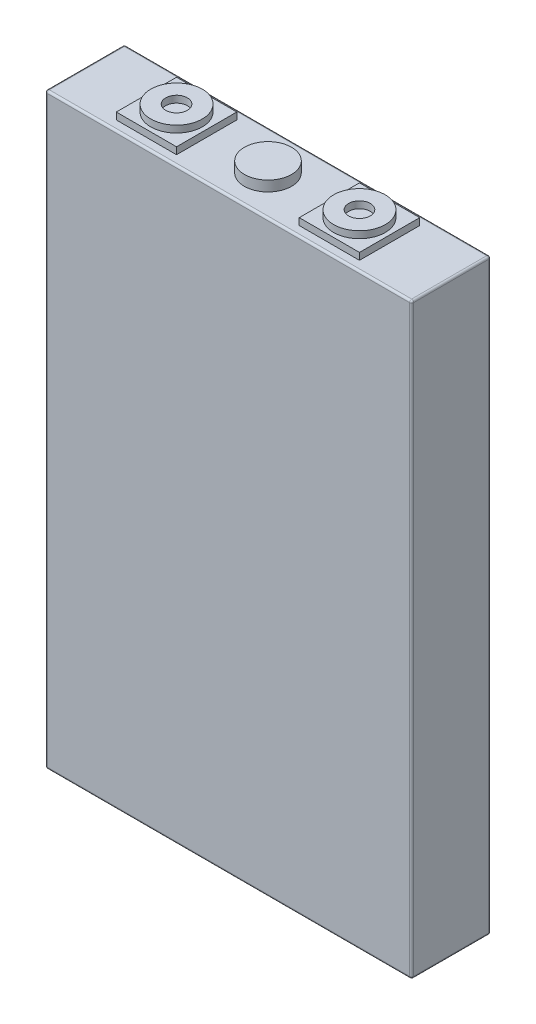
ISO-10303-21;
HEADER;
FILE_DESCRIPTION(('STEP AP214'),'2;1');
FILE_NAME('part.step','',(''),(''),'','','');
FILE_SCHEMA(('AUTOMOTIVE_DESIGN { 1 0 10303 214 1 1 1 1 }'));
ENDSEC;
DATA;
#1=APPLICATION_CONTEXT('core data for automotive mechanical design processes');
#2=APPLICATION_PROTOCOL_DEFINITION('international standard','automotive_design',2000,#1);
#3=PRODUCT_CONTEXT('',#1,'mechanical');
#4=PRODUCT('Part','Part','',(#3));
#5=PRODUCT_RELATED_PRODUCT_CATEGORY('part','',(#4));
#6=PRODUCT_DEFINITION_FORMATION('','',#4);
#7=PRODUCT_DEFINITION_CONTEXT('part definition',#1,'design');
#8=PRODUCT_DEFINITION('design','',#6,#7);
#9=PRODUCT_DEFINITION_SHAPE('','',#8);
#10=(LENGTH_UNIT() NAMED_UNIT(*) SI_UNIT(.MILLI.,.METRE.));
#11=(NAMED_UNIT(*) PLANE_ANGLE_UNIT() SI_UNIT($,.RADIAN.));
#12=(NAMED_UNIT(*) SI_UNIT($,.STERADIAN.) SOLID_ANGLE_UNIT());
#13=UNCERTAINTY_MEASURE_WITH_UNIT(LENGTH_MEASURE(1.E-05),#10,'distance_accuracy_value','');
#14=(GEOMETRIC_REPRESENTATION_CONTEXT(3) GLOBAL_UNCERTAINTY_ASSIGNED_CONTEXT((#13)) GLOBAL_UNIT_ASSIGNED_CONTEXT((#10,
#11,#12)) REPRESENTATION_CONTEXT('',''));
#15=CARTESIAN_POINT('',(0.,0.,0.));
#16=DIRECTION('',(0.,0.,1.));
#17=DIRECTION('',(1.,0.,0.));
#18=AXIS2_PLACEMENT_3D('',#15,#16,#17);
#19=CARTESIAN_POINT('',(67.6,220.61,-14.6));
#20=DIRECTION('',(0.,-1.,0.));
#21=DIRECTION('',(0.,0.,-1.));
#22=AXIS2_PLACEMENT_3D('',#19,#20,#21);
#23=CYLINDRICAL_SURFACE('',#22,8.69809987955637);
#24=CARTESIAN_POINT('',(67.6,220.61,-14.6));
#25=DIRECTION('',(0.,1.,0.));
#26=DIRECTION('',(0.,0.,1.));
#27=AXIS2_PLACEMENT_3D('',#24,#25,#26);
#28=CIRCLE('',#27,8.69809987955637);
#29=CARTESIAN_POINT('',(67.6,220.61,-5.90190012044363));
#30=VERTEX_POINT('',#29);
#31=EDGE_CURVE('E11',#30,#30,#28,.T.);
#32=ORIENTED_EDGE('',*,*,#31,.F.);
#33=EDGE_LOOP('',(#32));
#34=FACE_BOUND('',#33,.T.);
#35=CARTESIAN_POINT('',(67.6,216.8,-14.6));
#36=DIRECTION('',(0.,1.,0.));
#37=DIRECTION('',(0.,0.,1.));
#38=AXIS2_PLACEMENT_3D('',#35,#36,#37);
#39=CIRCLE('',#38,8.69809987955637);
#40=CARTESIAN_POINT('',(67.6,216.8,-5.90190012044363));
#41=VERTEX_POINT('',#40);
#42=EDGE_CURVE('E43',#41,#41,#39,.T.);
#43=ORIENTED_EDGE('',*,*,#42,.T.);
#44=EDGE_LOOP('',(#43));
#45=FACE_BOUND('',#44,.T.);
#46=ADVANCED_FACE('F40',(#34,#45),#23,.T.);
#47=CARTESIAN_POINT('',(67.6,220.61,-14.6));
#48=DIRECTION('',(0.,1.,0.));
#49=DIRECTION('',(0.,0.,1.));
#50=AXIS2_PLACEMENT_3D('',#47,#48,#49);
#51=PLANE('',#50);
#52=ORIENTED_EDGE('',*,*,#31,.T.);
#53=EDGE_LOOP('',(#52));
#54=FACE_BOUND('',#53,.T.);
#55=ADVANCED_FACE('F55',(#54),#51,.T.);
#56=CARTESIAN_POINT('',(67.6,216.8,-14.6));
#57=DIRECTION('',(0.,1.,0.));
#58=DIRECTION('',(0.,0.,1.));
#59=AXIS2_PLACEMENT_3D('',#56,#57,#58);
#60=PLANE('',#59);
#61=ORIENTED_EDGE('',*,*,#42,.F.);
#62=EDGE_LOOP('',(#61));
#63=FACE_BOUND('',#62,.T.);
#64=ADVANCED_FACE('F53',(#63),#60,.F.);
#65=CLOSED_SHELL('',(#46,#55,#64));
#66=MANIFOLD_SOLID_BREP('B2',#65);
#67=CARTESIAN_POINT('',(101.35,221.88,-14.6));
#68=DIRECTION('',(0.,1.,0.));
#69=DIRECTION('',(0.,0.,1.));
#70=AXIS2_PLACEMENT_3D('',#67,#68,#69);
#71=PLANE('',#70);
#72=CARTESIAN_POINT('',(101.35,221.88,-14.6));
#73=DIRECTION('',(0.,1.,0.));
#74=DIRECTION('',(0.,0.,1.));
#75=AXIS2_PLACEMENT_3D('',#72,#73,#74);
#76=CIRCLE('',#75,9.52500000000001);
#77=CARTESIAN_POINT('',(101.35,221.88,-5.07500000000001));
#78=VERTEX_POINT('',#77);
#79=EDGE_CURVE('E39',#78,#78,#76,.T.);
#80=ORIENTED_EDGE('',*,*,#79,.T.);
#81=EDGE_LOOP('',(#80));
#82=FACE_BOUND('',#81,.T.);
#83=CARTESIAN_POINT('',(101.35,221.88,-14.6));
#84=DIRECTION('',(0.,1.,0.));
#85=DIRECTION('',(0.,0.,1.));
#86=AXIS2_PLACEMENT_3D('',#83,#84,#85);
#87=CIRCLE('',#86,4.00000000000001);
#88=CARTESIAN_POINT('',(101.35,221.88,-10.6));
#89=VERTEX_POINT('',#88);
#90=EDGE_CURVE('E100',#89,#89,#87,.T.);
#91=ORIENTED_EDGE('',*,*,#90,.F.);
#92=EDGE_LOOP('',(#91));
#93=FACE_BOUND('',#92,.T.);
#94=ADVANCED_FACE('F89',(#82,#93),#71,.T.);
#95=CARTESIAN_POINT('',(101.35,219.34,-14.6));
#96=DIRECTION('',(0.,1.,0.));
#97=DIRECTION('',(0.,0.,1.));
#98=AXIS2_PLACEMENT_3D('',#95,#96,#97);
#99=PLANE('',#98);
#100=CARTESIAN_POINT('',(101.35,219.34,-14.6));
#101=DIRECTION('',(0.,1.,0.));
#102=DIRECTION('',(0.,0.,1.));
#103=AXIS2_PLACEMENT_3D('',#100,#101,#102);
#104=CIRCLE('',#103,9.52500000000001);
#105=CARTESIAN_POINT('',(101.35,219.34,-5.07500000000001));
#106=VERTEX_POINT('',#105);
#107=EDGE_CURVE('E93',#106,#106,#104,.T.);
#108=ORIENTED_EDGE('',*,*,#107,.F.);
#109=EDGE_LOOP('',(#108));
#110=FACE_BOUND('',#109,.T.);
#111=CARTESIAN_POINT('',(101.35,219.34,-14.6));
#112=DIRECTION('',(0.,1.,0.));
#113=DIRECTION('',(0.,0.,1.));
#114=AXIS2_PLACEMENT_3D('',#111,#112,#113);
#115=CIRCLE('',#114,4.00000000000001);
#116=CARTESIAN_POINT('',(101.35,219.34,-10.6));
#117=VERTEX_POINT('',#116);
#118=EDGE_CURVE('E102',#117,#117,#115,.T.);
#119=ORIENTED_EDGE('',*,*,#118,.T.);
#120=EDGE_LOOP('',(#119));
#121=FACE_BOUND('',#120,.T.);
#122=ADVANCED_FACE('F112',(#110,#121),#99,.F.);
#123=CARTESIAN_POINT('',(101.35,221.88,-14.6));
#124=DIRECTION('',(0.,-1.,0.));
#125=DIRECTION('',(0.,0.,-1.));
#126=AXIS2_PLACEMENT_3D('',#123,#124,#125);
#127=CYLINDRICAL_SURFACE('',#126,9.52500000000001);
#128=ORIENTED_EDGE('',*,*,#79,.F.);
#129=EDGE_LOOP('',(#128));
#130=FACE_BOUND('',#129,.T.);
#131=ORIENTED_EDGE('',*,*,#107,.T.);
#132=EDGE_LOOP('',(#131));
#133=FACE_BOUND('',#132,.T.);
#134=ADVANCED_FACE('F91',(#130,#133),#127,.T.);
#135=CARTESIAN_POINT('',(101.35,221.88,-14.6));
#136=DIRECTION('',(0.,-1.,0.));
#137=DIRECTION('',(0.,0.,-1.));
#138=AXIS2_PLACEMENT_3D('',#135,#136,#137);
#139=CYLINDRICAL_SURFACE('',#138,4.00000000000001);
#140=ORIENTED_EDGE('',*,*,#90,.T.);
#141=EDGE_LOOP('',(#140));
#142=FACE_BOUND('',#141,.T.);
#143=ORIENTED_EDGE('',*,*,#118,.F.);
#144=EDGE_LOOP('',(#143));
#145=FACE_BOUND('',#144,.T.);
#146=ADVANCED_FACE('F108',(#142,#145),#139,.F.);
#147=CLOSED_SHELL('',(#94,#122,#134,#146));
#148=MANIFOLD_SOLID_BREP('B6',#147);
#149=CARTESIAN_POINT('',(33.85,221.88,-14.6));
#150=DIRECTION('',(0.,1.,0.));
#151=DIRECTION('',(0.,0.,1.));
#152=AXIS2_PLACEMENT_3D('',#149,#150,#151);
#153=PLANE('',#152);
#154=CARTESIAN_POINT('',(33.85,221.88,-14.6));
#155=DIRECTION('',(0.,1.,0.));
#156=DIRECTION('',(0.,0.,1.));
#157=AXIS2_PLACEMENT_3D('',#154,#155,#156);
#158=CIRCLE('',#157,9.525);
#159=CARTESIAN_POINT('',(33.85,221.88,-5.07500000000002));
#160=VERTEX_POINT('',#159);
#161=EDGE_CURVE('E88',#160,#160,#158,.T.);
#162=ORIENTED_EDGE('',*,*,#161,.T.);
#163=EDGE_LOOP('',(#162));
#164=FACE_BOUND('',#163,.T.);
#165=CARTESIAN_POINT('',(33.85,221.88,-14.6));
#166=DIRECTION('',(0.,1.,0.));
#167=DIRECTION('',(0.,0.,1.));
#168=AXIS2_PLACEMENT_3D('',#165,#166,#167);
#169=CIRCLE('',#168,4.);
#170=CARTESIAN_POINT('',(33.85,221.88,-10.6));
#171=VERTEX_POINT('',#170);
#172=EDGE_CURVE('E172',#171,#171,#169,.T.);
#173=ORIENTED_EDGE('',*,*,#172,.F.);
#174=EDGE_LOOP('',(#173));
#175=FACE_BOUND('',#174,.T.);
#176=ADVANCED_FACE('F161',(#164,#175),#153,.T.);
#177=CARTESIAN_POINT('',(33.85,219.34,-14.6));
#178=DIRECTION('',(0.,1.,0.));
#179=DIRECTION('',(0.,0.,1.));
#180=AXIS2_PLACEMENT_3D('',#177,#178,#179);
#181=PLANE('',#180);
#182=CARTESIAN_POINT('',(33.85,219.34,-14.6));
#183=DIRECTION('',(0.,1.,0.));
#184=DIRECTION('',(0.,0.,1.));
#185=AXIS2_PLACEMENT_3D('',#182,#183,#184);
#186=CIRCLE('',#185,9.525);
#187=CARTESIAN_POINT('',(33.85,219.34,-5.07500000000002));
#188=VERTEX_POINT('',#187);
#189=EDGE_CURVE('E165',#188,#188,#186,.T.);
#190=ORIENTED_EDGE('',*,*,#189,.F.);
#191=EDGE_LOOP('',(#190));
#192=FACE_BOUND('',#191,.T.);
#193=CARTESIAN_POINT('',(33.85,219.34,-14.6));
#194=DIRECTION('',(0.,1.,0.));
#195=DIRECTION('',(0.,0.,1.));
#196=AXIS2_PLACEMENT_3D('',#193,#194,#195);
#197=CIRCLE('',#196,4.);
#198=CARTESIAN_POINT('',(33.85,219.34,-10.6));
#199=VERTEX_POINT('',#198);
#200=EDGE_CURVE('E174',#199,#199,#197,.T.);
#201=ORIENTED_EDGE('',*,*,#200,.T.);
#202=EDGE_LOOP('',(#201));
#203=FACE_BOUND('',#202,.T.);
#204=ADVANCED_FACE('F184',(#192,#203),#181,.F.);
#205=CARTESIAN_POINT('',(33.85,221.88,-14.6));
#206=DIRECTION('',(0.,-1.,0.));
#207=DIRECTION('',(0.,0.,-1.));
#208=AXIS2_PLACEMENT_3D('',#205,#206,#207);
#209=CYLINDRICAL_SURFACE('',#208,9.525);
#210=ORIENTED_EDGE('',*,*,#161,.F.);
#211=EDGE_LOOP('',(#210));
#212=FACE_BOUND('',#211,.T.);
#213=ORIENTED_EDGE('',*,*,#189,.T.);
#214=EDGE_LOOP('',(#213));
#215=FACE_BOUND('',#214,.T.);
#216=ADVANCED_FACE('F163',(#212,#215),#209,.T.);
#217=CARTESIAN_POINT('',(33.85,221.88,-14.6));
#218=DIRECTION('',(0.,-1.,0.));
#219=DIRECTION('',(0.,0.,-1.));
#220=AXIS2_PLACEMENT_3D('',#217,#218,#219);
#221=CYLINDRICAL_SURFACE('',#220,4.);
#222=ORIENTED_EDGE('',*,*,#172,.T.);
#223=EDGE_LOOP('',(#222));
#224=FACE_BOUND('',#223,.T.);
#225=ORIENTED_EDGE('',*,*,#200,.F.);
#226=EDGE_LOOP('',(#225));
#227=FACE_BOUND('',#226,.T.);
#228=ADVANCED_FACE('F180',(#224,#227),#221,.F.);
#229=CLOSED_SHELL('',(#176,#204,#216,#228));
#230=MANIFOLD_SOLID_BREP('B34',#229);
#231=CARTESIAN_POINT('',(112.4625,219.34,-25.7125));
#232=DIRECTION('',(-1.,0.,0.));
#233=DIRECTION('',(0.,0.,1.));
#234=AXIS2_PLACEMENT_3D('',#231,#232,#233);
#235=PLANE('',#234);
#236=DIRECTION('',(0.,0.,-1.));
#237=VECTOR('',#236,1.);
#238=CARTESIAN_POINT('',(112.4625,216.8,-25.7125));
#239=LINE('',#238,#237);
#240=CARTESIAN_POINT('',(112.4625,216.8,-3.48750000000002));
#241=VERTEX_POINT('',#240);
#242=CARTESIAN_POINT('',(112.4625,216.8,-25.7125));
#243=VERTEX_POINT('',#242);
#244=EDGE_CURVE('E296',#241,#243,#239,.T.);
#245=ORIENTED_EDGE('',*,*,#244,.T.);
#246=DIRECTION('',(0.,-1.,0.));
#247=VECTOR('',#246,1.);
#248=CARTESIAN_POINT('',(112.4625,219.34,-25.7125));
#249=LINE('',#248,#247);
#250=CARTESIAN_POINT('',(112.4625,219.34,-25.7125));
#251=VERTEX_POINT('',#250);
#252=EDGE_CURVE('E159',#251,#243,#249,.T.);
#253=ORIENTED_EDGE('',*,*,#252,.F.);
#254=DIRECTION('',(0.,0.,-1.));
#255=VECTOR('',#254,1.);
#256=CARTESIAN_POINT('',(112.4625,219.34,-25.7125));
#257=LINE('',#256,#255);
#258=CARTESIAN_POINT('',(112.4625,219.34,-3.48750000000002));
#259=VERTEX_POINT('',#258);
#260=EDGE_CURVE('E284',#259,#251,#257,.T.);
#261=ORIENTED_EDGE('',*,*,#260,.F.);
#262=DIRECTION('',(0.,-1.,0.));
#263=VECTOR('',#262,1.);
#264=CARTESIAN_POINT('',(112.4625,219.34,-3.48750000000002));
#265=LINE('',#264,#263);
#266=EDGE_CURVE('E292',#259,#241,#265,.T.);
#267=ORIENTED_EDGE('',*,*,#266,.T.);
#268=EDGE_LOOP('',(#245,#253,#261,#267));
#269=FACE_BOUND('',#268,.T.);
#270=ADVANCED_FACE('F233',(#269),#235,.F.);
#271=CARTESIAN_POINT('',(90.2375,219.34,-25.7125));
#272=DIRECTION('',(0.,0.,1.));
#273=DIRECTION('',(1.,0.,0.));
#274=AXIS2_PLACEMENT_3D('',#271,#272,#273);
#275=PLANE('',#274);
#276=DIRECTION('',(-1.,0.,0.));
#277=VECTOR('',#276,1.);
#278=CARTESIAN_POINT('',(90.2375,216.8,-25.7125));
#279=LINE('',#278,#277);
#280=CARTESIAN_POINT('',(90.2375,216.8,-25.7125));
#281=VERTEX_POINT('',#280);
#282=EDGE_CURVE('E288',#243,#281,#279,.T.);
#283=ORIENTED_EDGE('',*,*,#282,.T.);
#284=DIRECTION('',(0.,-1.,0.));
#285=VECTOR('',#284,1.);
#286=CARTESIAN_POINT('',(90.2375,219.34,-25.7125));
#287=LINE('',#286,#285);
#288=CARTESIAN_POINT('',(90.2375,219.34,-25.7125));
#289=VERTEX_POINT('',#288);
#290=EDGE_CURVE('E241',#289,#281,#287,.T.);
#291=ORIENTED_EDGE('',*,*,#290,.F.);
#292=DIRECTION('',(-1.,0.,0.));
#293=VECTOR('',#292,1.);
#294=CARTESIAN_POINT('',(90.2375,219.34,-25.7125));
#295=LINE('',#294,#293);
#296=EDGE_CURVE('E279',#251,#289,#295,.T.);
#297=ORIENTED_EDGE('',*,*,#296,.F.);
#298=ORIENTED_EDGE('',*,*,#252,.T.);
#299=EDGE_LOOP('',(#283,#291,#297,#298));
#300=FACE_BOUND('',#299,.T.);
#301=ADVANCED_FACE('F287',(#300),#275,.F.);
#302=CARTESIAN_POINT('',(90.2375,219.34,-25.7125));
#303=DIRECTION('',(1.,0.,0.));
#304=DIRECTION('',(0.,0.,-1.));
#305=AXIS2_PLACEMENT_3D('',#302,#303,#304);
#306=PLANE('',#305);
#307=DIRECTION('',(0.,0.,1.));
#308=VECTOR('',#307,1.);
#309=CARTESIAN_POINT('',(90.2375,216.8,-25.7125));
#310=LINE('',#309,#308);
#311=CARTESIAN_POINT('',(90.2375,216.8,-3.48750000000002));
#312=VERTEX_POINT('',#311);
#313=EDGE_CURVE('E266',#281,#312,#310,.T.);
#314=ORIENTED_EDGE('',*,*,#313,.T.);
#315=DIRECTION('',(0.,-1.,0.));
#316=VECTOR('',#315,1.);
#317=CARTESIAN_POINT('',(90.2375,219.34,-3.48750000000002));
#318=LINE('',#317,#316);
#319=CARTESIAN_POINT('',(90.2375,219.34,-3.48750000000002));
#320=VERTEX_POINT('',#319);
#321=EDGE_CURVE('E289',#320,#312,#318,.T.);
#322=ORIENTED_EDGE('',*,*,#321,.F.);
#323=DIRECTION('',(0.,0.,1.));
#324=VECTOR('',#323,1.);
#325=CARTESIAN_POINT('',(90.2375,219.34,-25.7125));
#326=LINE('',#325,#324);
#327=EDGE_CURVE('E282',#289,#320,#326,.T.);
#328=ORIENTED_EDGE('',*,*,#327,.F.);
#329=ORIENTED_EDGE('',*,*,#290,.T.);
#330=EDGE_LOOP('',(#314,#322,#328,#329));
#331=FACE_BOUND('',#330,.T.);
#332=ADVANCED_FACE('F290',(#331),#306,.F.);
#333=CARTESIAN_POINT('',(90.2375,219.34,-3.48750000000002));
#334=DIRECTION('',(0.,0.,-1.));
#335=DIRECTION('',(-1.,0.,0.));
#336=AXIS2_PLACEMENT_3D('',#333,#334,#335);
#337=PLANE('',#336);
#338=DIRECTION('',(1.,0.,0.));
#339=VECTOR('',#338,1.);
#340=CARTESIAN_POINT('',(90.2375,216.8,-3.48750000000002));
#341=LINE('',#340,#339);
#342=EDGE_CURVE('E272',#312,#241,#341,.T.);
#343=ORIENTED_EDGE('',*,*,#342,.T.);
#344=ORIENTED_EDGE('',*,*,#266,.F.);
#345=DIRECTION('',(1.,0.,0.));
#346=VECTOR('',#345,1.);
#347=CARTESIAN_POINT('',(90.2375,219.34,-3.48750000000002));
#348=LINE('',#347,#346);
#349=EDGE_CURVE('E249',#320,#259,#348,.T.);
#350=ORIENTED_EDGE('',*,*,#349,.F.);
#351=ORIENTED_EDGE('',*,*,#321,.T.);
#352=EDGE_LOOP('',(#343,#344,#350,#351));
#353=FACE_BOUND('',#352,.T.);
#354=ADVANCED_FACE('F303',(#353),#337,.F.);
#355=CARTESIAN_POINT('',(112.4625,219.34,-3.48750000000002));
#356=DIRECTION('',(0.,1.,0.));
#357=DIRECTION('',(0.,0.,1.));
#358=AXIS2_PLACEMENT_3D('',#355,#356,#357);
#359=PLANE('',#358);
#360=ORIENTED_EDGE('',*,*,#260,.T.);
#361=ORIENTED_EDGE('',*,*,#296,.T.);
#362=ORIENTED_EDGE('',*,*,#327,.T.);
#363=ORIENTED_EDGE('',*,*,#349,.T.);
#364=EDGE_LOOP('',(#360,#361,#362,#363));
#365=FACE_BOUND('',#364,.T.);
#366=ADVANCED_FACE('F280',(#365),#359,.T.);
#367=CARTESIAN_POINT('',(112.4625,216.8,-3.48750000000002));
#368=DIRECTION('',(0.,1.,0.));
#369=DIRECTION('',(0.,0.,1.));
#370=AXIS2_PLACEMENT_3D('',#367,#368,#369);
#371=PLANE('',#370);
#372=ORIENTED_EDGE('',*,*,#244,.F.);
#373=ORIENTED_EDGE('',*,*,#342,.F.);
#374=ORIENTED_EDGE('',*,*,#313,.F.);
#375=ORIENTED_EDGE('',*,*,#282,.F.);
#376=EDGE_LOOP('',(#372,#373,#374,#375));
#377=FACE_BOUND('',#376,.T.);
#378=ADVANCED_FACE('F306',(#377),#371,.F.);
#379=CLOSED_SHELL('',(#270,#301,#332,#354,#366,#378));
#380=MANIFOLD_SOLID_BREP('B83',#379);
#381=CARTESIAN_POINT('',(22.7375,219.34,-25.7125));
#382=DIRECTION('',(1.,0.,0.));
#383=DIRECTION('',(0.,0.,-1.));
#384=AXIS2_PLACEMENT_3D('',#381,#382,#383);
#385=PLANE('',#384);
#386=DIRECTION('',(0.,0.,1.));
#387=VECTOR('',#386,1.);
#388=CARTESIAN_POINT('',(22.7375,216.8,-25.7125));
#389=LINE('',#388,#387);
#390=CARTESIAN_POINT('',(22.7375,216.8,-25.7125));
#391=VERTEX_POINT('',#390);
#392=CARTESIAN_POINT('',(22.7375,216.8,-3.48750000000002));
#393=VERTEX_POINT('',#392);
#394=EDGE_CURVE('E429',#391,#393,#389,.T.);
#395=ORIENTED_EDGE('',*,*,#394,.T.);
#396=DIRECTION('',(0.,-1.,0.));
#397=VECTOR('',#396,1.);
#398=CARTESIAN_POINT('',(22.7375,219.34,-3.48750000000002));
#399=LINE('',#398,#397);
#400=CARTESIAN_POINT('',(22.7375,219.34,-3.48750000000002));
#401=VERTEX_POINT('',#400);
#402=EDGE_CURVE('E231',#401,#393,#399,.T.);
#403=ORIENTED_EDGE('',*,*,#402,.F.);
#404=DIRECTION('',(0.,0.,1.));
#405=VECTOR('',#404,1.);
#406=CARTESIAN_POINT('',(22.7375,219.34,-25.7125));
#407=LINE('',#406,#405);
#408=CARTESIAN_POINT('',(22.7375,219.34,-25.7125));
#409=VERTEX_POINT('',#408);
#410=EDGE_CURVE('E417',#409,#401,#407,.T.);
#411=ORIENTED_EDGE('',*,*,#410,.F.);
#412=DIRECTION('',(0.,-1.,0.));
#413=VECTOR('',#412,1.);
#414=CARTESIAN_POINT('',(22.7375,219.34,-25.7125));
#415=LINE('',#414,#413);
#416=EDGE_CURVE('E425',#409,#391,#415,.T.);
#417=ORIENTED_EDGE('',*,*,#416,.T.);
#418=EDGE_LOOP('',(#395,#403,#411,#417));
#419=FACE_BOUND('',#418,.T.);
#420=ADVANCED_FACE('F366',(#419),#385,.F.);
#421=CARTESIAN_POINT('',(44.9625,219.34,-3.48750000000002));
#422=DIRECTION('',(0.,0.,-1.));
#423=DIRECTION('',(-1.,0.,0.));
#424=AXIS2_PLACEMENT_3D('',#421,#422,#423);
#425=PLANE('',#424);
#426=DIRECTION('',(1.,0.,0.));
#427=VECTOR('',#426,1.);
#428=CARTESIAN_POINT('',(44.9625,216.8,-3.48750000000002));
#429=LINE('',#428,#427);
#430=CARTESIAN_POINT('',(44.9625,216.8,-3.48750000000002));
#431=VERTEX_POINT('',#430);
#432=EDGE_CURVE('E421',#393,#431,#429,.T.);
#433=ORIENTED_EDGE('',*,*,#432,.T.);
#434=DIRECTION('',(0.,-1.,0.));
#435=VECTOR('',#434,1.);
#436=CARTESIAN_POINT('',(44.9625,219.34,-3.48750000000002));
#437=LINE('',#436,#435);
#438=CARTESIAN_POINT('',(44.9625,219.34,-3.48750000000002));
#439=VERTEX_POINT('',#438);
#440=EDGE_CURVE('E374',#439,#431,#437,.T.);
#441=ORIENTED_EDGE('',*,*,#440,.F.);
#442=DIRECTION('',(1.,0.,0.));
#443=VECTOR('',#442,1.);
#444=CARTESIAN_POINT('',(44.9625,219.34,-3.48750000000002));
#445=LINE('',#444,#443);
#446=EDGE_CURVE('E412',#401,#439,#445,.T.);
#447=ORIENTED_EDGE('',*,*,#446,.F.);
#448=ORIENTED_EDGE('',*,*,#402,.T.);
#449=EDGE_LOOP('',(#433,#441,#447,#448));
#450=FACE_BOUND('',#449,.T.);
#451=ADVANCED_FACE('F420',(#450),#425,.F.);
#452=CARTESIAN_POINT('',(44.9625,219.34,-25.7125));
#453=DIRECTION('',(-1.,0.,0.));
#454=DIRECTION('',(0.,0.,1.));
#455=AXIS2_PLACEMENT_3D('',#452,#453,#454);
#456=PLANE('',#455);
#457=DIRECTION('',(0.,0.,-1.));
#458=VECTOR('',#457,1.);
#459=CARTESIAN_POINT('',(44.9625,216.8,-25.7125));
#460=LINE('',#459,#458);
#461=CARTESIAN_POINT('',(44.9625,216.8,-25.7125));
#462=VERTEX_POINT('',#461);
#463=EDGE_CURVE('E399',#431,#462,#460,.T.);
#464=ORIENTED_EDGE('',*,*,#463,.T.);
#465=DIRECTION('',(0.,-1.,0.));
#466=VECTOR('',#465,1.);
#467=CARTESIAN_POINT('',(44.9625,219.34,-25.7125));
#468=LINE('',#467,#466);
#469=CARTESIAN_POINT('',(44.9625,219.34,-25.7125));
#470=VERTEX_POINT('',#469);
#471=EDGE_CURVE('E422',#470,#462,#468,.T.);
#472=ORIENTED_EDGE('',*,*,#471,.F.);
#473=DIRECTION('',(0.,0.,-1.));
#474=VECTOR('',#473,1.);
#475=CARTESIAN_POINT('',(44.9625,219.34,-25.7125));
#476=LINE('',#475,#474);
#477=EDGE_CURVE('E415',#439,#470,#476,.T.);
#478=ORIENTED_EDGE('',*,*,#477,.F.);
#479=ORIENTED_EDGE('',*,*,#440,.T.);
#480=EDGE_LOOP('',(#464,#472,#478,#479));
#481=FACE_BOUND('',#480,.T.);
#482=ADVANCED_FACE('F423',(#481),#456,.F.);
#483=CARTESIAN_POINT('',(44.9625,219.34,-25.7125));
#484=DIRECTION('',(0.,0.,1.));
#485=DIRECTION('',(1.,0.,0.));
#486=AXIS2_PLACEMENT_3D('',#483,#484,#485);
#487=PLANE('',#486);
#488=DIRECTION('',(-1.,0.,0.));
#489=VECTOR('',#488,1.);
#490=CARTESIAN_POINT('',(44.9625,216.8,-25.7125));
#491=LINE('',#490,#489);
#492=EDGE_CURVE('E405',#462,#391,#491,.T.);
#493=ORIENTED_EDGE('',*,*,#492,.T.);
#494=ORIENTED_EDGE('',*,*,#416,.F.);
#495=DIRECTION('',(-1.,0.,0.));
#496=VECTOR('',#495,1.);
#497=CARTESIAN_POINT('',(44.9625,219.34,-25.7125));
#498=LINE('',#497,#496);
#499=EDGE_CURVE('E382',#470,#409,#498,.T.);
#500=ORIENTED_EDGE('',*,*,#499,.F.);
#501=ORIENTED_EDGE('',*,*,#471,.T.);
#502=EDGE_LOOP('',(#493,#494,#500,#501));
#503=FACE_BOUND('',#502,.T.);
#504=ADVANCED_FACE('F436',(#503),#487,.F.);
#505=CARTESIAN_POINT('',(22.7375,219.34,-3.48750000000002));
#506=DIRECTION('',(0.,-1.,0.));
#507=DIRECTION('',(0.,0.,-1.));
#508=AXIS2_PLACEMENT_3D('',#505,#506,#507);
#509=PLANE('',#508);
#510=ORIENTED_EDGE('',*,*,#410,.T.);
#511=ORIENTED_EDGE('',*,*,#446,.T.);
#512=ORIENTED_EDGE('',*,*,#477,.T.);
#513=ORIENTED_EDGE('',*,*,#499,.T.);
#514=EDGE_LOOP('',(#510,#511,#512,#513));
#515=FACE_BOUND('',#514,.T.);
#516=ADVANCED_FACE('F413',(#515),#509,.F.);
#517=CARTESIAN_POINT('',(22.7375,216.8,-3.48750000000002));
#518=DIRECTION('',(0.,-1.,0.));
#519=DIRECTION('',(0.,0.,-1.));
#520=AXIS2_PLACEMENT_3D('',#517,#518,#519);
#521=PLANE('',#520);
#522=ORIENTED_EDGE('',*,*,#394,.F.);
#523=ORIENTED_EDGE('',*,*,#492,.F.);
#524=ORIENTED_EDGE('',*,*,#463,.F.);
#525=ORIENTED_EDGE('',*,*,#432,.F.);
#526=EDGE_LOOP('',(#522,#523,#524,#525));
#527=FACE_BOUND('',#526,.T.);
#528=ADVANCED_FACE('F439',(#527),#521,.T.);
#529=CLOSED_SHELL('',(#420,#451,#482,#504,#516,#528));
#530=MANIFOLD_SOLID_BREP('B153',#529);
#531=CARTESIAN_POINT('',(0.,216.8,0.));
#532=DIRECTION('',(1.,0.,0.));
#533=DIRECTION('',(0.,0.,-1.));
#534=AXIS2_PLACEMENT_3D('',#531,#532,#533);
#535=PLANE('',#534);
#536=DIRECTION('',(0.,0.,1.));
#537=VECTOR('',#536,1.);
#538=CARTESIAN_POINT('',(0.,216.038,0.));
#539=LINE('',#538,#537);
#540=CARTESIAN_POINT('',(0.,216.038,-0.762));
#541=VERTEX_POINT('',#540);
#542=CARTESIAN_POINT('',(0.,216.038,-28.438));
#543=VERTEX_POINT('',#542);
#544=EDGE_CURVE('E499',#541,#543,#539,.F.);
#545=ORIENTED_EDGE('',*,*,#544,.T.);
#546=DIRECTION('',(0.,-1.,0.));
#547=VECTOR('',#546,1.);
#548=CARTESIAN_POINT('',(0.,216.8,-28.438));
#549=LINE('',#548,#547);
#550=CARTESIAN_POINT('',(0.,0.762000000000013,-28.438));
#551=VERTEX_POINT('',#550);
#552=EDGE_CURVE('E364',#543,#551,#549,.T.);
#553=ORIENTED_EDGE('',*,*,#552,.T.);
#554=DIRECTION('',(0.,0.,1.));
#555=VECTOR('',#554,1.);
#556=CARTESIAN_POINT('',(0.,0.762000000000013,0.));
#557=LINE('',#556,#555);
#558=CARTESIAN_POINT('',(0.,0.762000000000013,-0.762));
#559=VERTEX_POINT('',#558);
#560=EDGE_CURVE('E651',#551,#559,#557,.T.);
#561=ORIENTED_EDGE('',*,*,#560,.T.);
#562=DIRECTION('',(0.,-1.,0.));
#563=VECTOR('',#562,1.);
#564=CARTESIAN_POINT('',(0.,216.8,-0.762));
#565=LINE('',#564,#563);
#566=EDGE_CURVE('E510',#559,#541,#565,.F.);
#567=ORIENTED_EDGE('',*,*,#566,.T.);
#568=EDGE_LOOP('',(#545,#553,#561,#567));
#569=FACE_BOUND('',#568,.T.);
#570=ADVANCED_FACE('F490',(#569),#535,.F.);
#571=CARTESIAN_POINT('',(0.,216.8,0.));
#572=DIRECTION('',(0.,0.,-1.));
#573=DIRECTION('',(-1.,0.,0.));
#574=AXIS2_PLACEMENT_3D('',#571,#572,#573);
#575=PLANE('',#574);
#576=DIRECTION('',(0.,-1.,0.));
#577=VECTOR('',#576,1.);
#578=CARTESIAN_POINT('',(134.438,216.8,0.));
#579=LINE('',#578,#577);
#580=CARTESIAN_POINT('',(134.438,0.762000000000013,0.));
#581=VERTEX_POINT('',#580);
#582=CARTESIAN_POINT('',(134.438,216.038,0.));
#583=VERTEX_POINT('',#582);
#584=EDGE_CURVE('E646',#581,#583,#579,.F.);
#585=ORIENTED_EDGE('',*,*,#584,.T.);
#586=DIRECTION('',(1.,0.,0.));
#587=VECTOR('',#586,1.);
#588=CARTESIAN_POINT('',(0.,216.038,0.));
#589=LINE('',#588,#587);
#590=CARTESIAN_POINT('',(0.762,216.038,0.));
#591=VERTEX_POINT('',#590);
#592=EDGE_CURVE('E648',#583,#591,#589,.F.);
#593=ORIENTED_EDGE('',*,*,#592,.T.);
#594=DIRECTION('',(0.,-1.,0.));
#595=VECTOR('',#594,1.);
#596=CARTESIAN_POINT('',(0.762,216.8,0.));
#597=LINE('',#596,#595);
#598=CARTESIAN_POINT('',(0.762,0.762000000000013,0.));
#599=VERTEX_POINT('',#598);
#600=EDGE_CURVE('E642',#591,#599,#597,.T.);
#601=ORIENTED_EDGE('',*,*,#600,.T.);
#602=DIRECTION('',(1.,0.,0.));
#603=VECTOR('',#602,1.);
#604=CARTESIAN_POINT('',(135.2,0.762000000000013,0.));
#605=LINE('',#604,#603);
#606=EDGE_CURVE('E644',#599,#581,#605,.T.);
#607=ORIENTED_EDGE('',*,*,#606,.T.);
#608=EDGE_LOOP('',(#585,#593,#601,#607));
#609=FACE_BOUND('',#608,.T.);
#610=ADVANCED_FACE('F735',(#609),#575,.F.);
#611=CARTESIAN_POINT('',(135.2,216.8,0.));
#612=DIRECTION('',(-1.,0.,0.));
#613=DIRECTION('',(0.,0.,1.));
#614=AXIS2_PLACEMENT_3D('',#611,#612,#613);
#615=PLANE('',#614);
#616=DIRECTION('',(0.,-1.,0.));
#617=VECTOR('',#616,1.);
#618=CARTESIAN_POINT('',(135.2,216.8,-28.438));
#619=LINE('',#618,#617);
#620=CARTESIAN_POINT('',(135.2,0.762000000000013,-28.438));
#621=VERTEX_POINT('',#620);
#622=CARTESIAN_POINT('',(135.2,216.038,-28.438));
#623=VERTEX_POINT('',#622);
#624=EDGE_CURVE('E637',#621,#623,#619,.F.);
#625=ORIENTED_EDGE('',*,*,#624,.T.);
#626=DIRECTION('',(0.,0.,-1.));
#627=VECTOR('',#626,1.);
#628=CARTESIAN_POINT('',(135.2,216.038,0.));
#629=LINE('',#628,#627);
#630=CARTESIAN_POINT('',(135.2,216.038,-0.762));
#631=VERTEX_POINT('',#630);
#632=EDGE_CURVE('E639',#623,#631,#629,.F.);
#633=ORIENTED_EDGE('',*,*,#632,.T.);
#634=DIRECTION('',(0.,-1.,0.));
#635=VECTOR('',#634,1.);
#636=CARTESIAN_POINT('',(135.2,216.8,-0.762));
#637=LINE('',#636,#635);
#638=CARTESIAN_POINT('',(135.2,0.762000000000013,-0.762));
#639=VERTEX_POINT('',#638);
#640=EDGE_CURVE('E633',#631,#639,#637,.T.);
#641=ORIENTED_EDGE('',*,*,#640,.T.);
#642=DIRECTION('',(0.,0.,-1.));
#643=VECTOR('',#642,1.);
#644=CARTESIAN_POINT('',(135.2,0.762000000000013,-29.2));
#645=LINE('',#644,#643);
#646=EDGE_CURVE('E635',#639,#621,#645,.T.);
#647=ORIENTED_EDGE('',*,*,#646,.T.);
#648=EDGE_LOOP('',(#625,#633,#641,#647));
#649=FACE_BOUND('',#648,.T.);
#650=ADVANCED_FACE('F726',(#649),#615,.F.);
#651=CARTESIAN_POINT('',(0.,216.8,-29.2));
#652=DIRECTION('',(0.,0.,1.));
#653=DIRECTION('',(1.,0.,0.));
#654=AXIS2_PLACEMENT_3D('',#651,#652,#653);
#655=PLANE('',#654);
#656=DIRECTION('',(-1.,0.,0.));
#657=VECTOR('',#656,1.);
#658=CARTESIAN_POINT('',(0.,216.038,-29.2));
#659=LINE('',#658,#657);
#660=CARTESIAN_POINT('',(0.762,216.038,-29.2));
#661=VERTEX_POINT('',#660);
#662=CARTESIAN_POINT('',(134.438,216.038,-29.2));
#663=VERTEX_POINT('',#662);
#664=EDGE_CURVE('E586',#661,#663,#659,.F.);
#665=ORIENTED_EDGE('',*,*,#664,.T.);
#666=DIRECTION('',(0.,-1.,0.));
#667=VECTOR('',#666,1.);
#668=CARTESIAN_POINT('',(134.438,216.8,-29.2));
#669=LINE('',#668,#667);
#670=CARTESIAN_POINT('',(134.438,0.762000000000013,-29.2));
#671=VERTEX_POINT('',#670);
#672=EDGE_CURVE('E622',#663,#671,#669,.T.);
#673=ORIENTED_EDGE('',*,*,#672,.T.);
#674=DIRECTION('',(-1.,0.,0.));
#675=VECTOR('',#674,1.);
#676=CARTESIAN_POINT('',(0.,0.762000000000013,-29.2));
#677=LINE('',#676,#675);
#678=CARTESIAN_POINT('',(0.762,0.762000000000013,-29.2));
#679=VERTEX_POINT('',#678);
#680=EDGE_CURVE('E615',#671,#679,#677,.T.);
#681=ORIENTED_EDGE('',*,*,#680,.T.);
#682=DIRECTION('',(0.,-1.,0.));
#683=VECTOR('',#682,1.);
#684=CARTESIAN_POINT('',(0.762,216.8,-29.2));
#685=LINE('',#684,#683);
#686=EDGE_CURVE('E613',#679,#661,#685,.F.);
#687=ORIENTED_EDGE('',*,*,#686,.T.);
#688=EDGE_LOOP('',(#665,#673,#681,#687));
#689=FACE_BOUND('',#688,.T.);
#690=ADVANCED_FACE('F813',(#689),#655,.F.);
#691=CARTESIAN_POINT('',(0.,216.8,-29.2));
#692=DIRECTION('',(0.,-1.,0.));
#693=DIRECTION('',(0.,0.,-1.));
#694=AXIS2_PLACEMENT_3D('',#691,#692,#693);
#695=PLANE('',#694);
#696=DIRECTION('',(0.,0.,-1.));
#697=VECTOR('',#696,1.);
#698=CARTESIAN_POINT('',(134.438,216.8,-29.2));
#699=LINE('',#698,#697);
#700=CARTESIAN_POINT('',(134.438,216.8,-0.761999999999999));
#701=VERTEX_POINT('',#700);
#702=CARTESIAN_POINT('',(134.438,216.8,-28.438));
#703=VERTEX_POINT('',#702);
#704=EDGE_CURVE('E611',#701,#703,#699,.T.);
#705=ORIENTED_EDGE('',*,*,#704,.T.);
#706=DIRECTION('',(-1.,0.,0.));
#707=VECTOR('',#706,1.);
#708=CARTESIAN_POINT('',(0.,216.8,-28.438));
#709=LINE('',#708,#707);
#710=CARTESIAN_POINT('',(0.762,216.8,-28.438));
#711=VERTEX_POINT('',#710);
#712=EDGE_CURVE('E584',#703,#711,#709,.T.);
#713=ORIENTED_EDGE('',*,*,#712,.T.);
#714=DIRECTION('',(0.,0.,1.));
#715=VECTOR('',#714,1.);
#716=CARTESIAN_POINT('',(0.762,216.8,-29.2));
#717=LINE('',#716,#715);
#718=CARTESIAN_POINT('',(0.762,216.8,-0.761999999999999));
#719=VERTEX_POINT('',#718);
#720=EDGE_CURVE('E601',#711,#719,#717,.T.);
#721=ORIENTED_EDGE('',*,*,#720,.T.);
#722=DIRECTION('',(1.,0.,0.));
#723=VECTOR('',#722,1.);
#724=CARTESIAN_POINT('',(0.,216.8,-0.761999999999999));
#725=LINE('',#724,#723);
#726=EDGE_CURVE('E607',#719,#701,#725,.T.);
#727=ORIENTED_EDGE('',*,*,#726,.T.);
#728=EDGE_LOOP('',(#705,#713,#721,#727));
#729=FACE_BOUND('',#728,.T.);
#730=ADVANCED_FACE('F609',(#729),#695,.F.);
#731=CARTESIAN_POINT('',(0.,0.,-29.2));
#732=DIRECTION('',(0.,-1.,0.));
#733=DIRECTION('',(0.,0.,-1.));
#734=AXIS2_PLACEMENT_3D('',#731,#732,#733);
#735=PLANE('',#734);
#736=DIRECTION('',(0.,0.,1.));
#737=VECTOR('',#736,1.);
#738=CARTESIAN_POINT('',(0.762,0.,-29.2));
#739=LINE('',#738,#737);
#740=CARTESIAN_POINT('',(0.762,0.,-0.762));
#741=VERTEX_POINT('',#740);
#742=CARTESIAN_POINT('',(0.762,0.,-28.438));
#743=VERTEX_POINT('',#742);
#744=EDGE_CURVE('E624',#741,#743,#739,.F.);
#745=ORIENTED_EDGE('',*,*,#744,.T.);
#746=DIRECTION('',(-1.,0.,0.));
#747=VECTOR('',#746,1.);
#748=CARTESIAN_POINT('',(135.2,0.,-28.438));
#749=LINE('',#748,#747);
#750=CARTESIAN_POINT('',(134.438,0.,-28.438));
#751=VERTEX_POINT('',#750);
#752=EDGE_CURVE('E630',#743,#751,#749,.F.);
#753=ORIENTED_EDGE('',*,*,#752,.T.);
#754=DIRECTION('',(0.,0.,-1.));
#755=VECTOR('',#754,1.);
#756=CARTESIAN_POINT('',(134.438,0.,0.));
#757=LINE('',#756,#755);
#758=CARTESIAN_POINT('',(134.438,0.,-0.762));
#759=VERTEX_POINT('',#758);
#760=EDGE_CURVE('E628',#751,#759,#757,.F.);
#761=ORIENTED_EDGE('',*,*,#760,.T.);
#762=DIRECTION('',(1.,0.,0.));
#763=VECTOR('',#762,1.);
#764=CARTESIAN_POINT('',(0.,0.,-0.762));
#765=LINE('',#764,#763);
#766=EDGE_CURVE('E626',#759,#741,#765,.F.);
#767=ORIENTED_EDGE('',*,*,#766,.T.);
#768=EDGE_LOOP('',(#745,#753,#761,#767));
#769=FACE_BOUND('',#768,.T.);
#770=ADVANCED_FACE('F753',(#769),#735,.T.);
#771=CARTESIAN_POINT('',(0.,0.762000000000013,-0.762));
#772=DIRECTION('',(-1.,0.,0.));
#773=DIRECTION('',(0.,0.,1.));
#774=AXIS2_PLACEMENT_3D('',#771,#772,#773);
#775=CYLINDRICAL_SURFACE('',#774,0.762);
#776=CARTESIAN_POINT('',(134.438,0.762000000000013,-0.762));
#777=DIRECTION('',(1.,0.,0.));
#778=DIRECTION('',(0.,0.,-1.));
#779=AXIS2_PLACEMENT_3D('',#776,#777,#778);
#780=CIRCLE('',#779,0.762);
#781=EDGE_CURVE('E494',#581,#759,#780,.T.);
#782=ORIENTED_EDGE('',*,*,#781,.F.);
#783=ORIENTED_EDGE('',*,*,#606,.F.);
#784=CARTESIAN_POINT('',(0.762,0.762,-0.762));
#785=DIRECTION('',(-1.,0.,0.));
#786=DIRECTION('',(0.,0.,1.));
#787=AXIS2_PLACEMENT_3D('',#784,#785,#786);
#788=CIRCLE('',#787,0.762);
#789=EDGE_CURVE('E703',#741,#599,#788,.T.);
#790=ORIENTED_EDGE('',*,*,#789,.F.);
#791=ORIENTED_EDGE('',*,*,#766,.F.);
#792=EDGE_LOOP('',(#782,#783,#790,#791));
#793=FACE_BOUND('',#792,.T.);
#794=ADVANCED_FACE('F492',(#793),#775,.T.);
#795=CARTESIAN_POINT('',(134.438,0.762,-0.762));
#796=DIRECTION('',(0.,0.,1.));
#797=DIRECTION('',(1.,0.,0.));
#798=AXIS2_PLACEMENT_3D('',#795,#796,#797);
#799=SPHERICAL_SURFACE('',#798,0.762);
#800=CARTESIAN_POINT('',(134.438,0.762000000000013,-0.762));
#801=DIRECTION('',(0.,-1.,0.));
#802=DIRECTION('',(0.,0.,-1.));
#803=AXIS2_PLACEMENT_3D('',#800,#801,#802);
#804=CIRCLE('',#803,0.762);
#805=EDGE_CURVE('E698',#581,#639,#804,.F.);
#806=ORIENTED_EDGE('',*,*,#805,.F.);
#807=ORIENTED_EDGE('',*,*,#781,.T.);
#808=CARTESIAN_POINT('',(134.438,0.762,-0.762));
#809=DIRECTION('',(0.,0.,1.));
#810=DIRECTION('',(1.,0.,0.));
#811=AXIS2_PLACEMENT_3D('',#808,#809,#810);
#812=CIRCLE('',#811,0.762);
#813=EDGE_CURVE('E701',#639,#759,#812,.F.);
#814=ORIENTED_EDGE('',*,*,#813,.F.);
#815=EDGE_LOOP('',(#806,#807,#814));
#816=FACE_BOUND('',#815,.T.);
#817=ADVANCED_FACE('F714',(#816),#799,.T.);
#818=CARTESIAN_POINT('',(0.762,0.762,-0.762));
#819=DIRECTION('',(0.,0.,1.));
#820=DIRECTION('',(1.,0.,0.));
#821=AXIS2_PLACEMENT_3D('',#818,#819,#820);
#822=SPHERICAL_SURFACE('',#821,0.762);
#823=CARTESIAN_POINT('',(0.762,0.762000000000013,-0.762));
#824=DIRECTION('',(0.,0.,1.));
#825=DIRECTION('',(1.,0.,0.));
#826=AXIS2_PLACEMENT_3D('',#823,#824,#825);
#827=CIRCLE('',#826,0.762);
#828=EDGE_CURVE('E692',#741,#559,#827,.F.);
#829=ORIENTED_EDGE('',*,*,#828,.F.);
#830=ORIENTED_EDGE('',*,*,#789,.T.);
#831=CARTESIAN_POINT('',(0.762,0.762000000000013,-0.762));
#832=DIRECTION('',(0.,-1.,0.));
#833=DIRECTION('',(0.,0.,-1.));
#834=AXIS2_PLACEMENT_3D('',#831,#832,#833);
#835=CIRCLE('',#834,0.762);
#836=EDGE_CURVE('E695',#559,#599,#835,.F.);
#837=ORIENTED_EDGE('',*,*,#836,.F.);
#838=EDGE_LOOP('',(#829,#830,#837));
#839=FACE_BOUND('',#838,.T.);
#840=ADVANCED_FACE('F746',(#839),#822,.T.);
#841=CARTESIAN_POINT('',(134.438,0.762000000000013,0.));
#842=DIRECTION('',(0.,0.,1.));
#843=DIRECTION('',(1.,0.,0.));
#844=AXIS2_PLACEMENT_3D('',#841,#842,#843);
#845=CYLINDRICAL_SURFACE('',#844,0.762);
#846=ORIENTED_EDGE('',*,*,#813,.T.);
#847=ORIENTED_EDGE('',*,*,#760,.F.);
#848=CARTESIAN_POINT('',(134.438,0.762000000000013,-28.438));
#849=DIRECTION('',(0.,0.,-1.));
#850=DIRECTION('',(-1.,0.,0.));
#851=AXIS2_PLACEMENT_3D('',#848,#849,#850);
#852=CIRCLE('',#851,0.762);
#853=EDGE_CURVE('E687',#621,#751,#852,.T.);
#854=ORIENTED_EDGE('',*,*,#853,.F.);
#855=ORIENTED_EDGE('',*,*,#646,.F.);
#856=EDGE_LOOP('',(#846,#847,#854,#855));
#857=FACE_BOUND('',#856,.T.);
#858=ADVANCED_FACE('F722',(#857),#845,.T.);
#859=CARTESIAN_POINT('',(134.438,216.8,-0.762));
#860=DIRECTION('',(0.,-1.,0.));
#861=DIRECTION('',(0.,0.,-1.));
#862=AXIS2_PLACEMENT_3D('',#859,#860,#861);
#863=CYLINDRICAL_SURFACE('',#862,0.762);
#864=ORIENTED_EDGE('',*,*,#805,.T.);
#865=ORIENTED_EDGE('',*,*,#640,.F.);
#866=CARTESIAN_POINT('',(134.438,216.038,-0.762));
#867=DIRECTION('',(0.,1.,0.));
#868=DIRECTION('',(0.,0.,1.));
#869=AXIS2_PLACEMENT_3D('',#866,#867,#868);
#870=CIRCLE('',#869,0.762);
#871=EDGE_CURVE('E684',#583,#631,#870,.T.);
#872=ORIENTED_EDGE('',*,*,#871,.F.);
#873=ORIENTED_EDGE('',*,*,#584,.F.);
#874=EDGE_LOOP('',(#864,#865,#872,#873));
#875=FACE_BOUND('',#874,.T.);
#876=ADVANCED_FACE('F732',(#875),#863,.T.);
#877=CARTESIAN_POINT('',(0.,216.038,-0.761999999999999));
#878=DIRECTION('',(1.,0.,0.));
#879=DIRECTION('',(0.,0.,-1.));
#880=AXIS2_PLACEMENT_3D('',#877,#878,#879);
#881=CYLINDRICAL_SURFACE('',#880,0.762);
#882=CARTESIAN_POINT('',(0.762,216.038,-0.762));
#883=DIRECTION('',(-1.,0.,0.));
#884=DIRECTION('',(0.,0.,1.));
#885=AXIS2_PLACEMENT_3D('',#882,#883,#884);
#886=CIRCLE('',#885,0.762);
#887=EDGE_CURVE('E678',#591,#719,#886,.T.);
#888=ORIENTED_EDGE('',*,*,#887,.F.);
#889=ORIENTED_EDGE('',*,*,#592,.F.);
#890=CARTESIAN_POINT('',(134.438,216.038,-0.761999999999999));
#891=DIRECTION('',(1.,0.,0.));
#892=DIRECTION('',(0.,0.,-1.));
#893=AXIS2_PLACEMENT_3D('',#890,#891,#892);
#894=CIRCLE('',#893,0.762);
#895=EDGE_CURVE('E681',#701,#583,#894,.T.);
#896=ORIENTED_EDGE('',*,*,#895,.F.);
#897=ORIENTED_EDGE('',*,*,#726,.F.);
#898=EDGE_LOOP('',(#888,#889,#896,#897));
#899=FACE_BOUND('',#898,.T.);
#900=ADVANCED_FACE('F739',(#899),#881,.T.);
#901=CARTESIAN_POINT('',(0.762,216.8,-0.762));
#902=DIRECTION('',(0.,-1.,0.));
#903=DIRECTION('',(0.,0.,-1.));
#904=AXIS2_PLACEMENT_3D('',#901,#902,#903);
#905=CYLINDRICAL_SURFACE('',#904,0.762);
#906=ORIENTED_EDGE('',*,*,#836,.T.);
#907=ORIENTED_EDGE('',*,*,#600,.F.);
#908=CARTESIAN_POINT('',(0.762,216.038,-0.762));
#909=DIRECTION('',(0.,1.,0.));
#910=DIRECTION('',(0.,0.,1.));
#911=AXIS2_PLACEMENT_3D('',#908,#909,#910);
#912=CIRCLE('',#911,0.762);
#913=EDGE_CURVE('E676',#541,#591,#912,.T.);
#914=ORIENTED_EDGE('',*,*,#913,.F.);
#915=ORIENTED_EDGE('',*,*,#566,.F.);
#916=EDGE_LOOP('',(#906,#907,#914,#915));
#917=FACE_BOUND('',#916,.T.);
#918=ADVANCED_FACE('F744',(#917),#905,.T.);
#919=CARTESIAN_POINT('',(0.762,0.762000000000013,0.));
#920=DIRECTION('',(0.,0.,-1.));
#921=DIRECTION('',(-1.,0.,0.));
#922=AXIS2_PLACEMENT_3D('',#919,#920,#921);
#923=CYLINDRICAL_SURFACE('',#922,0.762);
#924=ORIENTED_EDGE('',*,*,#828,.T.);
#925=ORIENTED_EDGE('',*,*,#560,.F.);
#926=CARTESIAN_POINT('',(0.762,0.762,-28.438));
#927=DIRECTION('',(0.,0.,-1.));
#928=DIRECTION('',(-1.,0.,0.));
#929=AXIS2_PLACEMENT_3D('',#926,#927,#928);
#930=CIRCLE('',#929,0.762);
#931=EDGE_CURVE('E673',#743,#551,#930,.T.);
#932=ORIENTED_EDGE('',*,*,#931,.F.);
#933=ORIENTED_EDGE('',*,*,#744,.F.);
#934=EDGE_LOOP('',(#924,#925,#932,#933));
#935=FACE_BOUND('',#934,.T.);
#936=ADVANCED_FACE('F750',(#935),#923,.T.);
#937=CARTESIAN_POINT('',(0.,0.762000000000013,-28.438));
#938=DIRECTION('',(1.,0.,0.));
#939=DIRECTION('',(0.,0.,-1.));
#940=AXIS2_PLACEMENT_3D('',#937,#938,#939);
#941=CYLINDRICAL_SURFACE('',#940,0.762);
#942=CARTESIAN_POINT('',(134.438,0.762,-28.438));
#943=DIRECTION('',(1.,0.,0.));
#944=DIRECTION('',(0.,0.,-1.));
#945=AXIS2_PLACEMENT_3D('',#942,#943,#944);
#946=CIRCLE('',#945,0.762);
#947=EDGE_CURVE('E689',#751,#671,#946,.T.);
#948=ORIENTED_EDGE('',*,*,#947,.F.);
#949=ORIENTED_EDGE('',*,*,#752,.F.);
#950=CARTESIAN_POINT('',(0.762,0.762000000000013,-28.438));
#951=DIRECTION('',(-1.,0.,0.));
#952=DIRECTION('',(0.,0.,1.));
#953=AXIS2_PLACEMENT_3D('',#950,#951,#952);
#954=CIRCLE('',#953,0.762);
#955=EDGE_CURVE('E670',#679,#743,#954,.T.);
#956=ORIENTED_EDGE('',*,*,#955,.F.);
#957=ORIENTED_EDGE('',*,*,#680,.F.);
#958=EDGE_LOOP('',(#948,#949,#956,#957));
#959=FACE_BOUND('',#958,.T.);
#960=ADVANCED_FACE('F757',(#959),#941,.T.);
#961=CARTESIAN_POINT('',(134.438,0.762,-28.438));
#962=DIRECTION('',(0.,0.,1.));
#963=DIRECTION('',(1.,0.,0.));
#964=AXIS2_PLACEMENT_3D('',#961,#962,#963);
#965=SPHERICAL_SURFACE('',#964,0.762);
#966=ORIENTED_EDGE('',*,*,#853,.T.);
#967=ORIENTED_EDGE('',*,*,#947,.T.);
#968=CARTESIAN_POINT('',(134.438,0.762000000000013,-28.438));
#969=DIRECTION('',(0.,-1.,0.));
#970=DIRECTION('',(0.,0.,-1.));
#971=AXIS2_PLACEMENT_3D('',#968,#969,#970);
#972=CIRCLE('',#971,0.762);
#973=EDGE_CURVE('E667',#621,#671,#972,.F.);
#974=ORIENTED_EDGE('',*,*,#973,.F.);
#975=EDGE_LOOP('',(#966,#967,#974));
#976=FACE_BOUND('',#975,.T.);
#977=ADVANCED_FACE('F761',(#976),#965,.T.);
#978=CARTESIAN_POINT('',(134.438,216.038,-0.762));
#979=DIRECTION('',(0.,0.,1.));
#980=DIRECTION('',(1.,0.,0.));
#981=AXIS2_PLACEMENT_3D('',#978,#979,#980);
#982=SPHERICAL_SURFACE('',#981,0.762);
#983=ORIENTED_EDGE('',*,*,#895,.T.);
#984=ORIENTED_EDGE('',*,*,#871,.T.);
#985=CARTESIAN_POINT('',(134.438,216.038,-0.762));
#986=DIRECTION('',(0.,0.,1.));
#987=DIRECTION('',(0.,-1.,0.));
#988=AXIS2_PLACEMENT_3D('',#985,#986,#987);
#989=CIRCLE('',#988,0.762);
#990=EDGE_CURVE('E665',#701,#631,#989,.F.);
#991=ORIENTED_EDGE('',*,*,#990,.F.);
#992=EDGE_LOOP('',(#983,#984,#991));
#993=FACE_BOUND('',#992,.T.);
#994=ADVANCED_FACE('F772',(#993),#982,.T.);
#995=CARTESIAN_POINT('',(0.762,216.038,-0.762));
#996=DIRECTION('',(0.,0.,1.));
#997=DIRECTION('',(1.,0.,0.));
#998=AXIS2_PLACEMENT_3D('',#995,#996,#997);
#999=SPHERICAL_SURFACE('',#998,0.762);
#1000=ORIENTED_EDGE('',*,*,#913,.T.);
#1001=ORIENTED_EDGE('',*,*,#887,.T.);
#1002=CARTESIAN_POINT('',(0.762,216.038,-0.761999999999999));
#1003=DIRECTION('',(0.,0.,1.));
#1004=DIRECTION('',(1.,0.,0.));
#1005=AXIS2_PLACEMENT_3D('',#1002,#1003,#1004);
#1006=CIRCLE('',#1005,0.762);
#1007=EDGE_CURVE('E604',#541,#719,#1006,.F.);
#1008=ORIENTED_EDGE('',*,*,#1007,.F.);
#1009=EDGE_LOOP('',(#1000,#1001,#1008));
#1010=FACE_BOUND('',#1009,.T.);
#1011=ADVANCED_FACE('F774',(#1010),#999,.T.);
#1012=CARTESIAN_POINT('',(0.762,0.762,-28.438));
#1013=DIRECTION('',(0.,0.,1.));
#1014=DIRECTION('',(1.,0.,0.));
#1015=AXIS2_PLACEMENT_3D('',#1012,#1013,#1014);
#1016=SPHERICAL_SURFACE('',#1015,0.762);
#1017=ORIENTED_EDGE('',*,*,#955,.T.);
#1018=ORIENTED_EDGE('',*,*,#931,.T.);
#1019=CARTESIAN_POINT('',(0.762,0.762000000000013,-28.438));
#1020=DIRECTION('',(0.,-1.,0.));
#1021=DIRECTION('',(0.,0.,-1.));
#1022=AXIS2_PLACEMENT_3D('',#1019,#1020,#1021);
#1023=CIRCLE('',#1022,0.762);
#1024=EDGE_CURVE('E662',#679,#551,#1023,.F.);
#1025=ORIENTED_EDGE('',*,*,#1024,.F.);
#1026=EDGE_LOOP('',(#1017,#1018,#1025));
#1027=FACE_BOUND('',#1026,.T.);
#1028=ADVANCED_FACE('F780',(#1027),#1016,.T.);
#1029=CARTESIAN_POINT('',(134.438,216.8,-28.438));
#1030=DIRECTION('',(0.,-1.,0.));
#1031=DIRECTION('',(0.,0.,-1.));
#1032=AXIS2_PLACEMENT_3D('',#1029,#1030,#1031);
#1033=CYLINDRICAL_SURFACE('',#1032,0.762);
#1034=ORIENTED_EDGE('',*,*,#973,.T.);
#1035=ORIENTED_EDGE('',*,*,#672,.F.);
#1036=CARTESIAN_POINT('',(134.438,216.038,-28.438));
#1037=DIRECTION('',(0.,1.,0.));
#1038=DIRECTION('',(0.,0.,1.));
#1039=AXIS2_PLACEMENT_3D('',#1036,#1037,#1038);
#1040=CIRCLE('',#1039,0.762);
#1041=EDGE_CURVE('E659',#623,#663,#1040,.T.);
#1042=ORIENTED_EDGE('',*,*,#1041,.F.);
#1043=ORIENTED_EDGE('',*,*,#624,.F.);
#1044=EDGE_LOOP('',(#1034,#1035,#1042,#1043));
#1045=FACE_BOUND('',#1044,.T.);
#1046=ADVANCED_FACE('F764',(#1045),#1033,.T.);
#1047=CARTESIAN_POINT('',(134.438,216.038,-29.2));
#1048=DIRECTION('',(0.,0.,-1.));
#1049=DIRECTION('',(-1.,0.,0.));
#1050=AXIS2_PLACEMENT_3D('',#1047,#1048,#1049);
#1051=CYLINDRICAL_SURFACE('',#1050,0.762);
#1052=ORIENTED_EDGE('',*,*,#990,.T.);
#1053=ORIENTED_EDGE('',*,*,#632,.F.);
#1054=CARTESIAN_POINT('',(134.438,216.038,-28.438));
#1055=DIRECTION('',(0.,0.,-1.));
#1056=DIRECTION('',(-1.,0.,0.));
#1057=AXIS2_PLACEMENT_3D('',#1054,#1055,#1056);
#1058=CIRCLE('',#1057,0.762);
#1059=EDGE_CURVE('E598',#703,#623,#1058,.T.);
#1060=ORIENTED_EDGE('',*,*,#1059,.F.);
#1061=ORIENTED_EDGE('',*,*,#704,.F.);
#1062=EDGE_LOOP('',(#1052,#1053,#1060,#1061));
#1063=FACE_BOUND('',#1062,.T.);
#1064=ADVANCED_FACE('F770',(#1063),#1051,.T.);
#1065=CARTESIAN_POINT('',(0.762,216.038,-29.2));
#1066=DIRECTION('',(0.,0.,1.));
#1067=DIRECTION('',(1.,0.,0.));
#1068=AXIS2_PLACEMENT_3D('',#1065,#1066,#1067);
#1069=CYLINDRICAL_SURFACE('',#1068,0.762);
#1070=ORIENTED_EDGE('',*,*,#1007,.T.);
#1071=ORIENTED_EDGE('',*,*,#720,.F.);
#1072=CARTESIAN_POINT('',(0.762,216.038,-28.438));
#1073=DIRECTION('',(0.,0.,-1.));
#1074=DIRECTION('',(-1.,0.,0.));
#1075=AXIS2_PLACEMENT_3D('',#1072,#1073,#1074);
#1076=CIRCLE('',#1075,0.762);
#1077=EDGE_CURVE('E592',#543,#711,#1076,.T.);
#1078=ORIENTED_EDGE('',*,*,#1077,.F.);
#1079=ORIENTED_EDGE('',*,*,#544,.F.);
#1080=EDGE_LOOP('',(#1070,#1071,#1078,#1079));
#1081=FACE_BOUND('',#1080,.T.);
#1082=ADVANCED_FACE('F602',(#1081),#1069,.T.);
#1083=CARTESIAN_POINT('',(0.762,216.8,-28.438));
#1084=DIRECTION('',(0.,-1.,0.));
#1085=DIRECTION('',(0.,0.,-1.));
#1086=AXIS2_PLACEMENT_3D('',#1083,#1084,#1085);
#1087=CYLINDRICAL_SURFACE('',#1086,0.762);
#1088=ORIENTED_EDGE('',*,*,#1024,.T.);
#1089=ORIENTED_EDGE('',*,*,#552,.F.);
#1090=CARTESIAN_POINT('',(0.762,216.038,-28.438));
#1091=DIRECTION('',(0.,1.,0.));
#1092=DIRECTION('',(0.,0.,1.));
#1093=AXIS2_PLACEMENT_3D('',#1090,#1091,#1092);
#1094=CIRCLE('',#1093,0.762);
#1095=EDGE_CURVE('E596',#661,#543,#1094,.T.);
#1096=ORIENTED_EDGE('',*,*,#1095,.F.);
#1097=ORIENTED_EDGE('',*,*,#686,.F.);
#1098=EDGE_LOOP('',(#1088,#1089,#1096,#1097));
#1099=FACE_BOUND('',#1098,.T.);
#1100=ADVANCED_FACE('F797',(#1099),#1087,.T.);
#1101=CARTESIAN_POINT('',(134.438,216.038,-28.438));
#1102=DIRECTION('',(0.,0.,1.));
#1103=DIRECTION('',(1.,0.,0.));
#1104=AXIS2_PLACEMENT_3D('',#1101,#1102,#1103);
#1105=SPHERICAL_SURFACE('',#1104,0.762);
#1106=ORIENTED_EDGE('',*,*,#1059,.T.);
#1107=ORIENTED_EDGE('',*,*,#1041,.T.);
#1108=CARTESIAN_POINT('',(134.438,216.038,-28.438));
#1109=DIRECTION('',(1.,0.,0.));
#1110=DIRECTION('',(0.,1.,0.));
#1111=AXIS2_PLACEMENT_3D('',#1108,#1109,#1110);
#1112=CIRCLE('',#1111,0.762);
#1113=EDGE_CURVE('E589',#703,#663,#1112,.F.);
#1114=ORIENTED_EDGE('',*,*,#1113,.F.);
#1115=EDGE_LOOP('',(#1106,#1107,#1114));
#1116=FACE_BOUND('',#1115,.T.);
#1117=ADVANCED_FACE('F768',(#1116),#1105,.T.);
#1118=CARTESIAN_POINT('',(0.762,216.038,-28.438));
#1119=DIRECTION('',(0.,0.,1.));
#1120=DIRECTION('',(1.,0.,0.));
#1121=AXIS2_PLACEMENT_3D('',#1118,#1119,#1120);
#1122=SPHERICAL_SURFACE('',#1121,0.762);
#1123=ORIENTED_EDGE('',*,*,#1095,.T.);
#1124=ORIENTED_EDGE('',*,*,#1077,.T.);
#1125=CARTESIAN_POINT('',(0.762,216.038,-28.438));
#1126=DIRECTION('',(-1.,0.,0.));
#1127=DIRECTION('',(0.,0.,1.));
#1128=AXIS2_PLACEMENT_3D('',#1125,#1126,#1127);
#1129=CIRCLE('',#1128,0.762);
#1130=EDGE_CURVE('E580',#661,#711,#1129,.F.);
#1131=ORIENTED_EDGE('',*,*,#1130,.F.);
#1132=EDGE_LOOP('',(#1123,#1124,#1131));
#1133=FACE_BOUND('',#1132,.T.);
#1134=ADVANCED_FACE('F594',(#1133),#1122,.T.);
#1135=CARTESIAN_POINT('',(0.,216.038,-28.438));
#1136=DIRECTION('',(-1.,0.,0.));
#1137=DIRECTION('',(0.,0.,1.));
#1138=AXIS2_PLACEMENT_3D('',#1135,#1136,#1137);
#1139=CYLINDRICAL_SURFACE('',#1138,0.762);
#1140=ORIENTED_EDGE('',*,*,#1113,.T.);
#1141=ORIENTED_EDGE('',*,*,#664,.F.);
#1142=ORIENTED_EDGE('',*,*,#1130,.T.);
#1143=ORIENTED_EDGE('',*,*,#712,.F.);
#1144=EDGE_LOOP('',(#1140,#1141,#1142,#1143));
#1145=FACE_BOUND('',#1144,.T.);
#1146=ADVANCED_FACE('F582',(#1145),#1139,.T.);
#1147=CLOSED_SHELL('',(#570,#610,#650,#690,#730,#770,#794,#817,#840,#858,#876,#900,#918,#936,
#960,#977,#994,#1011,#1028,#1046,#1064,#1082,#1100,#1117,#1134,#1146));
#1148=MANIFOLD_SOLID_BREP('B225',#1147);
#1149=ADVANCED_BREP_SHAPE_REPRESENTATION('',(#18,#66,#148,#230,#380,#530,#1148),#14);
#1150=SHAPE_DEFINITION_REPRESENTATION(#9,#1149);
ENDSEC;
END-ISO-10303-21;
